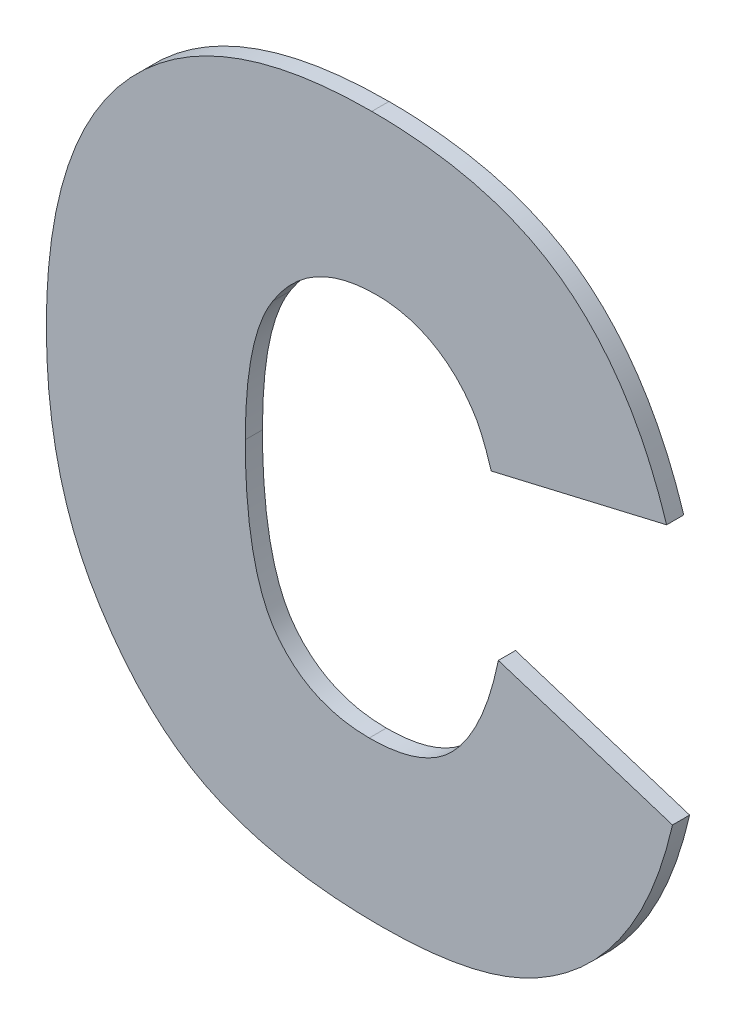
ISO-10303-21;
HEADER;
FILE_DESCRIPTION(('STEP AP214'),'2;1');
FILE_NAME('part.step','',(''),(''),'','','');
FILE_SCHEMA(('AUTOMOTIVE_DESIGN { 1 0 10303 214 1 1 1 1 }'));
ENDSEC;
DATA;
#1=APPLICATION_CONTEXT('core data for automotive mechanical design processes');
#2=APPLICATION_PROTOCOL_DEFINITION('international standard','automotive_design',2000,#1);
#3=PRODUCT_CONTEXT('',#1,'mechanical');
#4=PRODUCT('Part','Part','',(#3));
#5=PRODUCT_RELATED_PRODUCT_CATEGORY('part','',(#4));
#6=PRODUCT_DEFINITION_FORMATION('','',#4);
#7=PRODUCT_DEFINITION_CONTEXT('part definition',#1,'design');
#8=PRODUCT_DEFINITION('design','',#6,#7);
#9=PRODUCT_DEFINITION_SHAPE('','',#8);
#10=(LENGTH_UNIT() NAMED_UNIT(*) SI_UNIT(.MILLI.,.METRE.));
#11=(NAMED_UNIT(*) PLANE_ANGLE_UNIT() SI_UNIT($,.RADIAN.));
#12=(NAMED_UNIT(*) SI_UNIT($,.STERADIAN.) SOLID_ANGLE_UNIT());
#13=UNCERTAINTY_MEASURE_WITH_UNIT(LENGTH_MEASURE(1.E-05),#10,'distance_accuracy_value','');
#14=(GEOMETRIC_REPRESENTATION_CONTEXT(3) GLOBAL_UNCERTAINTY_ASSIGNED_CONTEXT((#13)) GLOBAL_UNIT_ASSIGNED_CONTEXT((#10,
#11,#12)) REPRESENTATION_CONTEXT('',''));
#15=CARTESIAN_POINT('',(0.,0.,0.));
#16=DIRECTION('',(0.,0.,1.));
#17=DIRECTION('',(1.,0.,0.));
#18=AXIS2_PLACEMENT_3D('',#15,#16,#17);
#19=CARTESIAN_POINT('',(0.829131792245526,-0.646000658730181,0.));
#20=DIRECTION('',(0.228030488835568,-0.973653992012261,0.));
#21=DIRECTION('',(0.973653992012261,0.228030488835568,0.));
#22=AXIS2_PLACEMENT_3D('',#19,#20,#21);
#23=PLANE('',#22);
#24=DIRECTION('',(0.973653992012261,0.228030488835568,0.));
#25=VECTOR('',#24,1.);
#26=CARTESIAN_POINT('',(0.829131792245526,-0.646000658730181,0.));
#27=LINE('',#26,#25);
#28=CARTESIAN_POINT('',(0.829131792245526,-0.646000658730181,0.));
#29=VERTEX_POINT('',#28);
#30=CARTESIAN_POINT('',(0.85982730677854,-0.638811746404606,0.));
#31=VERTEX_POINT('',#30);
#32=EDGE_CURVE('E11',#29,#31,#27,.T.);
#33=ORIENTED_EDGE('',*,*,#32,.T.);
#34=DIRECTION('',(0.,0.,1.));
#35=VECTOR('',#34,1.);
#36=CARTESIAN_POINT('',(0.85982730677854,-0.638811746404606,0.));
#37=LINE('',#36,#35);
#38=CARTESIAN_POINT('',(0.85982730677854,-0.638811746404606,0.003));
#39=VERTEX_POINT('',#38);
#40=EDGE_CURVE('E24',#31,#39,#37,.T.);
#41=ORIENTED_EDGE('',*,*,#40,.T.);
#42=DIRECTION('',(0.973653992012261,0.228030488835568,0.));
#43=VECTOR('',#42,1.);
#44=CARTESIAN_POINT('',(0.829131792245526,-0.646000658730181,0.003));
#45=LINE('',#44,#43);
#46=CARTESIAN_POINT('',(0.829131792245526,-0.646000658730181,0.003));
#47=VERTEX_POINT('',#46);
#48=EDGE_CURVE('E124',#47,#39,#45,.T.);
#49=ORIENTED_EDGE('',*,*,#48,.F.);
#50=DIRECTION('',(0.,0.,1.));
#51=VECTOR('',#50,1.);
#52=CARTESIAN_POINT('',(0.829131792245526,-0.646000658730181,0.));
#53=LINE('',#52,#51);
#54=EDGE_CURVE('E348',#29,#47,#53,.T.);
#55=ORIENTED_EDGE('',*,*,#54,.F.);
#56=EDGE_LOOP('',(#33,#41,#49,#55));
#57=FACE_BOUND('',#56,.T.);
#58=ADVANCED_FACE('F17',(#57),#23,.T.);
#59=CARTESIAN_POINT('',(0.825708500661921,-0.638127088087888,0.));
#60=CARTESIAN_POINT('',(0.825708500661921,-0.638127088087888,0.003));
#61=CARTESIAN_POINT('',(0.827534257231295,-0.640637501146391,0.));
#62=CARTESIAN_POINT('',(0.827534257231295,-0.640637501146391,0.003));
#63=CARTESIAN_POINT('',(0.829131792245526,-0.646000658730181,0.));
#64=CARTESIAN_POINT('',(0.829131792245526,-0.646000658730181,0.003));
#65=B_SPLINE_SURFACE_WITH_KNOTS('',2,1,((#59,#60),(#61,#62),(#63,#64)),.UNSPECIFIED.,.F.,.F.,
.F.,(3,3),(2,2),(-1.,0.),(0.,0.0003),.UNSPECIFIED.);
#66=CARTESIAN_POINT('',(0.825708500661921,-0.638127088087888,0.));
#67=CARTESIAN_POINT('',(0.827534257231295,-0.640637501146391,0.));
#68=CARTESIAN_POINT('',(0.829131792245526,-0.646000658730181,0.));
#69=B_SPLINE_CURVE_WITH_KNOTS('',2,(#66,#67,#68),.UNSPECIFIED.,.F.,.F.,(3,3),(-1.,0.),.UNSPECIFIED.);
#70=CARTESIAN_POINT('',(0.825708500661921,-0.638127088087888,0.));
#71=VERTEX_POINT('',#70);
#72=EDGE_CURVE('E338',#71,#29,#69,.T.);
#73=CARTESIAN_POINT('',(0.825708500661921,-0.638127088087888,0.003));
#74=CARTESIAN_POINT('',(0.827534257231295,-0.640637501146391,0.003));
#75=CARTESIAN_POINT('',(0.829131792245526,-0.646000658730181,0.003));
#76=B_SPLINE_CURVE_WITH_KNOTS('',2,(#73,#74,#75),.UNSPECIFIED.,.F.,.F.,(3,3),(-1.,0.),.UNSPECIFIED.);
#77=CARTESIAN_POINT('',(0.825708500661921,-0.638127088087888,0.003));
#78=VERTEX_POINT('',#77);
#79=EDGE_CURVE('E329',#78,#47,#76,.T.);
#80=DIRECTION('',(0.,0.,1.));
#81=VECTOR('',#80,1.);
#82=CARTESIAN_POINT('',(0.825708500661921,-0.638127088087888,0.));
#83=LINE('',#82,#81);
#84=EDGE_CURVE('E327',#71,#78,#83,.T.);
#85=ORIENTED_EDGE('',*,*,#72,.T.);
#86=ORIENTED_EDGE('',*,*,#54,.T.);
#87=ORIENTED_EDGE('',*,*,#79,.F.);
#88=ORIENTED_EDGE('',*,*,#84,.F.);
#89=EDGE_LOOP('',(#85,#86,#87,#88));
#90=FACE_BOUND('',#89,.T.);
#91=ADVANCED_FACE('F296',(#90),#65,.T.);
#92=CARTESIAN_POINT('',(0.825708500661921,-0.638127088087888,0.));
#93=CARTESIAN_POINT('',(0.819767609909563,-0.629278002142174,0.));
#94=CARTESIAN_POINT('',(0.809048481621696,-0.629340639689959,0.));
#95=CARTESIAN_POINT('',(0.825708500661921,-0.638127088087888,0.003));
#96=CARTESIAN_POINT('',(0.819767609909563,-0.629278002142174,0.003));
#97=CARTESIAN_POINT('',(0.809048481621696,-0.629340639689959,0.003));
#98=(BOUNDED_SURFACE() B_SPLINE_SURFACE(1,2,((#92,#93,#94),(#95,#96,#97)),.UNSPECIFIED.,.F.,.F.,
.F.) B_SPLINE_SURFACE_WITH_KNOTS((2,2),(3,3),(0.,0.0955551908147247),(-0.382239939426614,
0.409229730828909),
.UNSPECIFIED.) GEOMETRIC_REPRESENTATION_ITEM() RATIONAL_B_SPLINE_SURFACE(((1.,0.922713544612918,
1.),(1.,0.922713544612918,1.))) REPRESENTATION_ITEM('') SURFACE());
#99=CARTESIAN_POINT('',(0.809048481621696,-0.629340639689959,0.));
#100=CARTESIAN_POINT('',(0.809460357798463,-0.629338206307248,0.));
#101=CARTESIAN_POINT('',(0.809872391291396,-0.629347378233275,0.));
#102=CARTESIAN_POINT('',(0.810694763271972,-0.629389478681462,0.));
#103=CARTESIAN_POINT('',(0.811105103160338,-0.629422379986214,0.));
#104=CARTESIAN_POINT('',(0.811718357446488,-0.629489931848693,0.));
#105=CARTESIAN_POINT('',(0.811922305332792,-0.629515466361286,0.));
#106=CARTESIAN_POINT('',(0.812329195565191,-0.629572629401189,0.));
#107=CARTESIAN_POINT('',(0.812532138550533,-0.62960425334526,0.));
#108=CARTESIAN_POINT('',(0.81293681309316,-0.629673626171277,0.));
#109=CARTESIAN_POINT('',(0.813138545464128,-0.629711370309974,0.));
#110=CARTESIAN_POINT('',(0.813540601481279,-0.629793002539671,0.));
#111=CARTESIAN_POINT('',(0.813740926098435,-0.629836885844304,0.));
#112=CARTESIAN_POINT('',(0.814139967362067,-0.629930804228361,0.));
#113=CARTESIAN_POINT('',(0.814338685118197,-0.629980834591321,0.));
#114=CARTESIAN_POINT('',(0.814734315089902,-0.630087043300805,0.));
#115=CARTESIAN_POINT('',(0.814931228523601,-0.630143217108099,0.));
#116=CARTESIAN_POINT('',(0.815323053796636,-0.630261697252081,0.));
#117=CARTESIAN_POINT('',(0.815517966924733,-0.630323999325521,0.));
#118=CARTESIAN_POINT('',(0.815905597902412,-0.630454708805677,0.));
#119=CARTESIAN_POINT('',(0.816098317066619,-0.630523112312877,0.));
#120=CARTESIAN_POINT('',(0.816481369379095,-0.630665985722831,0.));
#121=CARTESIAN_POINT('',(0.81667170381814,-0.630740452164341,0.));
#122=CARTESIAN_POINT('',(0.817049799529665,-0.630895400814808,0.));
#123=CARTESIAN_POINT('',(0.817237562016462,-0.630975880060294,0.));
#124=CARTESIAN_POINT('',(0.817610330866184,-0.631142792109961,0.));
#125=CARTESIAN_POINT('',(0.817795338313771,-0.63122922249153,0.));
#126=CARTESIAN_POINT('',(0.818162418914387,-0.631407963189462,0.));
#127=CARTESIAN_POINT('',(0.81834449297107,-0.631500271649898,0.));
#128=CARTESIAN_POINT('',(0.818705533975186,-0.631690683687116,0.));
#129=CARTESIAN_POINT('',(0.818884501598192,-0.631788785982925,0.));
#130=CARTESIAN_POINT('',(0.819239162819613,-0.631990689951683,0.));
#131=CARTESIAN_POINT('',(0.819414856825084,-0.632094490909616,0.));
#132=CARTESIAN_POINT('',(0.819762810308813,-0.632307685867555,0.));
#133=CARTESIAN_POINT('',(0.81993506989397,-0.6324170796931,0.));
#134=CARTESIAN_POINT('',(0.820276000927277,-0.632641343828245,0.));
#135=CARTESIAN_POINT('',(0.820444672161188,-0.632756214463512,0.));
#136=CARTESIAN_POINT('',(0.820778280219897,-0.632991305856625,0.));
#137=CARTESIAN_POINT('',(0.820943216500486,-0.633111527386663,0.));
#138=CARTESIAN_POINT('',(0.821269216122064,-0.633357184861116,0.));
#139=CARTESIAN_POINT('',(0.821430278593236,-0.633482621959688,0.));
#140=CARTESIAN_POINT('',(0.821748400180388,-0.633738566028894,0.));
#141=CARTESIAN_POINT('',(0.821905458119066,-0.633869074462637,0.));
#142=CARTESIAN_POINT('',(0.822215448635653,-0.634135008307253,0.));
#143=CARTESIAN_POINT('',(0.822368379760716,-0.634270435411377,0.));
#144=CARTESIAN_POINT('',(0.82267000344164,-0.634546046105929,0.));
#145=CARTESIAN_POINT('',(0.822818694314493,-0.634686231537945,0.));
#146=CARTESIAN_POINT('',(0.823111732918148,-0.634971190670543,0.));
#147=CARTESIAN_POINT('',(0.823256078793513,-0.63511596627856,0.));
#148=CARTESIAN_POINT('',(0.823540333143741,-0.635409933122889,0.));
#149=CARTESIAN_POINT('',(0.823680239660321,-0.635559126253262,0.));
#150=CARTESIAN_POINT('',(0.823955525944665,-0.635861741655037,0.));
#151=CARTESIAN_POINT('',(0.824090903728072,-0.636015165727958,0.));
#152=CARTESIAN_POINT('',(0.824490199756791,-0.63648159475203,0.));
#153=CARTESIAN_POINT('',(0.824747141003148,-0.636800611856273,0.));
#154=CARTESIAN_POINT('',(0.825242145624277,-0.637453296622921,0.));
#155=CARTESIAN_POINT('',(0.82548019692912,-0.637786973444125,0.));
#156=CARTESIAN_POINT('',(0.825708500661921,-0.638127088087888,0.));
#157=B_SPLINE_CURVE_WITH_KNOTS('',3,(#99,#100,#101,#102,#103,#104,#105,#106,#107,#108,#109,#110,
#111,#112,#113,#114,#115,#116,#117,#118,#119,#120,#121,#122,#123,#124,#125,#126,#127,#128,#129,
#130,#131,#132,#133,#134,#135,#136,#137,#138,#139,#140,#141,#142,#143,#144,#145,#146,#147,#148,
#149,#150,#151,#152,#153,#154,#155,#156),.UNSPECIFIED.,.F.,.F.,(4,2,2,2,2,2,2,2,2,2,2,2,2,2,2,2,
2,2,2,2,2,2,2,2,2,2,2,2,4),(0.,0.00123564401995092,0.00246987301543477,0.0030864145634669,
0.00370249386967935,0.00431809796673437,0.00493322475891014,0.00554788249501255,
0.00616208910630262,0.00677587141462806,0.00738926421858814,0.0080023092681392,
0.00861505414049851,0.00922755103245661,0.00983985548614461,0.0104520250668772,
0.0110641180128576,0.0116761918771939,0.0122883021828552,0.012900501110875,0.0135128362412665,
0.0141253493648457,0.0147380753824472,0.0153510413059789,0.0159642653734439,0.0165777562875579,
0.0171915125849771,0.0184196274218652,0.0196485207607322),.UNSPECIFIED.);
#158=CARTESIAN_POINT('',(0.809048481621696,-0.629340639689959,0.));
#159=VERTEX_POINT('',#158);
#160=EDGE_CURVE('E324',#159,#71,#157,.T.);
#161=CARTESIAN_POINT('',(0.825708500661921,-0.638127088087888,0.003));
#162=CARTESIAN_POINT('',(0.819767609909563,-0.629278002142174,0.003));
#163=CARTESIAN_POINT('',(0.809048481621696,-0.629340639689959,0.003));
#164=(BOUNDED_CURVE() B_SPLINE_CURVE(2,(#161,#162,#163),.UNSPECIFIED.,.F.,
.F.) B_SPLINE_CURVE_WITH_KNOTS((3,3),(-0.382239939426614,0.409229730828909),
.UNSPECIFIED.) CURVE() GEOMETRIC_REPRESENTATION_ITEM() RATIONAL_B_SPLINE_CURVE((1.,
0.922713544612918,1.)) REPRESENTATION_ITEM(''));
#165=CARTESIAN_POINT('',(0.809048481621696,-0.629340639689959,0.003));
#166=VERTEX_POINT('',#165);
#167=EDGE_CURVE('E278',#166,#78,#164,.F.);
#168=DIRECTION('',(0.,0.,1.));
#169=VECTOR('',#168,1.);
#170=CARTESIAN_POINT('',(0.809048481621696,-0.629340639689959,0.));
#171=LINE('',#170,#169);
#172=EDGE_CURVE('E273',#159,#166,#171,.T.);
#173=ORIENTED_EDGE('',*,*,#160,.T.);
#174=ORIENTED_EDGE('',*,*,#84,.T.);
#175=ORIENTED_EDGE('',*,*,#167,.F.);
#176=ORIENTED_EDGE('',*,*,#172,.F.);
#177=EDGE_LOOP('',(#173,#174,#175,#176));
#178=FACE_BOUND('',#177,.T.);
#179=ADVANCED_FACE('F284',(#178),#98,.T.);
#180=CARTESIAN_POINT('',(0.790905036228577,-0.639382295001876,0.));
#181=CARTESIAN_POINT('',(0.790905036228577,-0.639382295001876,0.003));
#182=CARTESIAN_POINT('',(0.797181057210155,-0.629340631197296,0.));
#183=CARTESIAN_POINT('',(0.797181057210155,-0.629340631197296,0.003));
#184=CARTESIAN_POINT('',(0.809048481621696,-0.629340639689959,0.));
#185=CARTESIAN_POINT('',(0.809048481621696,-0.629340639689959,0.003));
#186=B_SPLINE_SURFACE_WITH_KNOTS('',2,1,((#180,#181),(#182,#183),(#184,#185)),.UNSPECIFIED.,.F.,
.F.,.F.,(3,3),(2,2),(-1.,0.),(0.,0.0003),.UNSPECIFIED.);
#187=CARTESIAN_POINT('',(0.790905036228577,-0.639382295001876,0.));
#188=CARTESIAN_POINT('',(0.797181057210155,-0.629340631197296,0.));
#189=CARTESIAN_POINT('',(0.809048481621696,-0.629340639689959,0.));
#190=B_SPLINE_CURVE_WITH_KNOTS('',2,(#187,#188,#189),.UNSPECIFIED.,.F.,.F.,(3,3),(-1.,0.),.UNSPECIFIED.);
#191=CARTESIAN_POINT('',(0.790905036228577,-0.639382295001876,0.));
#192=VERTEX_POINT('',#191);
#193=EDGE_CURVE('E263',#192,#159,#190,.T.);
#194=CARTESIAN_POINT('',(0.790905036228577,-0.639382295001876,0.003));
#195=CARTESIAN_POINT('',(0.797181057210155,-0.629340631197296,0.003));
#196=CARTESIAN_POINT('',(0.809048481621696,-0.629340639689959,0.003));
#197=B_SPLINE_CURVE_WITH_KNOTS('',2,(#194,#195,#196),.UNSPECIFIED.,.F.,.F.,(3,3),(-1.,0.),.UNSPECIFIED.);
#198=CARTESIAN_POINT('',(0.790905036228577,-0.639382295001876,0.003));
#199=VERTEX_POINT('',#198);
#200=EDGE_CURVE('E253',#199,#166,#197,.T.);
#201=DIRECTION('',(0.,0.,1.));
#202=VECTOR('',#201,1.);
#203=CARTESIAN_POINT('',(0.790905036228577,-0.639382295001876,0.));
#204=LINE('',#203,#202);
#205=EDGE_CURVE('E247',#192,#199,#204,.T.);
#206=ORIENTED_EDGE('',*,*,#193,.T.);
#207=ORIENTED_EDGE('',*,*,#172,.T.);
#208=ORIENTED_EDGE('',*,*,#200,.F.);
#209=ORIENTED_EDGE('',*,*,#205,.F.);
#210=EDGE_LOOP('',(#206,#207,#208,#209));
#211=FACE_BOUND('',#210,.T.);
#212=ADVANCED_FACE('F295',(#211),#186,.T.);
#213=CARTESIAN_POINT('',(0.786112428011526,-0.662774787489859,0.));
#214=CARTESIAN_POINT('',(0.786112428011526,-0.662774787489859,0.003));
#215=CARTESIAN_POINT('',(0.786112400537066,-0.646799426766351,0.));
#216=CARTESIAN_POINT('',(0.786112400537066,-0.646799426766351,0.003));
#217=CARTESIAN_POINT('',(0.790905036228577,-0.639382295001876,0.));
#218=CARTESIAN_POINT('',(0.790905036228577,-0.639382295001876,0.003));
#219=B_SPLINE_SURFACE_WITH_KNOTS('',2,1,((#213,#214),(#215,#216),(#217,#218)),.UNSPECIFIED.,.F.,
.F.,.F.,(3,3),(2,2),(-1.,0.),(0.,0.0003),.UNSPECIFIED.);
#220=CARTESIAN_POINT('',(0.786112428011526,-0.662774787489859,0.));
#221=CARTESIAN_POINT('',(0.786112400537066,-0.646799426766351,0.));
#222=CARTESIAN_POINT('',(0.790905036228577,-0.639382295001876,0.));
#223=B_SPLINE_CURVE_WITH_KNOTS('',2,(#220,#221,#222),.UNSPECIFIED.,.F.,.F.,(3,3),(-1.,0.),.UNSPECIFIED.);
#224=CARTESIAN_POINT('',(0.786112428011526,-0.662774787489859,0.));
#225=VERTEX_POINT('',#224);
#226=EDGE_CURVE('E239',#225,#192,#223,.T.);
#227=CARTESIAN_POINT('',(0.786112428011526,-0.662774787489859,0.003));
#228=CARTESIAN_POINT('',(0.786112400537066,-0.646799426766351,0.003));
#229=CARTESIAN_POINT('',(0.790905036228577,-0.639382295001876,0.003));
#230=B_SPLINE_CURVE_WITH_KNOTS('',2,(#227,#228,#229),.UNSPECIFIED.,.F.,.F.,(3,3),(-1.,0.),.UNSPECIFIED.);
#231=CARTESIAN_POINT('',(0.786112428011526,-0.662774787489859,0.003));
#232=VERTEX_POINT('',#231);
#233=EDGE_CURVE('E234',#232,#199,#230,.T.);
#234=DIRECTION('',(0.,0.,1.));
#235=VECTOR('',#234,1.);
#236=CARTESIAN_POINT('',(0.786112428011526,-0.662774787489859,0.));
#237=LINE('',#236,#235);
#238=EDGE_CURVE('E228',#225,#232,#237,.T.);
#239=ORIENTED_EDGE('',*,*,#226,.T.);
#240=ORIENTED_EDGE('',*,*,#205,.T.);
#241=ORIENTED_EDGE('',*,*,#233,.F.);
#242=ORIENTED_EDGE('',*,*,#238,.F.);
#243=EDGE_LOOP('',(#239,#240,#241,#242));
#244=FACE_BOUND('',#243,.T.);
#245=ADVANCED_FACE('F368',(#244),#219,.T.);
#246=CARTESIAN_POINT('',(0.807793274707708,-0.697121813045389,0.));
#247=CARTESIAN_POINT('',(0.807793274707708,-0.697121813045389,0.003));
#248=CARTESIAN_POINT('',(0.797523399956879,-0.69712181289239,0.));
#249=CARTESIAN_POINT('',(0.797523399956879,-0.69712181289239,0.003));
#250=CARTESIAN_POINT('',(0.78611242822908,-0.68251576863228,0.));
#251=CARTESIAN_POINT('',(0.78611242822908,-0.68251576863228,0.003));
#252=CARTESIAN_POINT('',(0.786112428011526,-0.662774787489859,0.));
#253=CARTESIAN_POINT('',(0.786112428011526,-0.662774787489859,0.003));
#254=B_SPLINE_SURFACE_WITH_KNOTS('',2,1,((#246,#247),(#248,#249),(#250,#251),(#252,#253)),
.UNSPECIFIED.,.F.,.F.,.F.,(3,1,3),(2,2),(-2.,-1.,0.),(0.,0.0003),.UNSPECIFIED.);
#255=CARTESIAN_POINT('',(0.807793274707708,-0.697121813045389,0.));
#256=CARTESIAN_POINT('',(0.797523399956879,-0.69712181289239,0.));
#257=CARTESIAN_POINT('',(0.78611242822908,-0.68251576863228,0.));
#258=CARTESIAN_POINT('',(0.786112428011526,-0.662774787489859,0.));
#259=B_SPLINE_CURVE_WITH_KNOTS('',2,(#255,#256,#257,#258),.UNSPECIFIED.,.F.,.F.,(3,1,3),(-2.,
-1.,0.),.UNSPECIFIED.);
#260=CARTESIAN_POINT('',(0.807793274707708,-0.697121813045389,0.));
#261=VERTEX_POINT('',#260);
#262=EDGE_CURVE('E220',#261,#225,#259,.T.);
#263=CARTESIAN_POINT('',(0.807793274707708,-0.697121813045389,0.003));
#264=CARTESIAN_POINT('',(0.797523399956879,-0.69712181289239,0.003));
#265=CARTESIAN_POINT('',(0.78611242822908,-0.68251576863228,0.003));
#266=CARTESIAN_POINT('',(0.786112428011526,-0.662774787489859,0.003));
#267=B_SPLINE_CURVE_WITH_KNOTS('',2,(#263,#264,#265,#266),.UNSPECIFIED.,.F.,.F.,(3,1,3),(-2.,
-1.,0.),.UNSPECIFIED.);
#268=CARTESIAN_POINT('',(0.807793274707708,-0.697121813045389,0.003));
#269=VERTEX_POINT('',#268);
#270=EDGE_CURVE('E215',#269,#232,#267,.T.);
#271=DIRECTION('',(0.,0.,1.));
#272=VECTOR('',#271,1.);
#273=CARTESIAN_POINT('',(0.807793274707708,-0.697121813045389,0.));
#274=LINE('',#273,#272);
#275=EDGE_CURVE('E209',#261,#269,#274,.T.);
#276=ORIENTED_EDGE('',*,*,#262,.T.);
#277=ORIENTED_EDGE('',*,*,#238,.T.);
#278=ORIENTED_EDGE('',*,*,#270,.F.);
#279=ORIENTED_EDGE('',*,*,#275,.F.);
#280=EDGE_LOOP('',(#276,#277,#278,#279));
#281=FACE_BOUND('',#280,.T.);
#282=ADVANCED_FACE('F365',(#281),#254,.T.);
#283=CARTESIAN_POINT('',(0.830386999159515,-0.674071649715764,0.));
#284=CARTESIAN_POINT('',(0.830386999159515,-0.674071649715764,0.003));
#285=CARTESIAN_POINT('',(0.828104811674292,-0.685368513336354,0.));
#286=CARTESIAN_POINT('',(0.828104811674292,-0.685368513336354,0.003));
#287=CARTESIAN_POINT('',(0.817834944106267,-0.69712182071634,0.));
#288=CARTESIAN_POINT('',(0.817834944106267,-0.69712182071634,0.003));
#289=CARTESIAN_POINT('',(0.807793274707708,-0.697121813045389,0.));
#290=CARTESIAN_POINT('',(0.807793274707708,-0.697121813045389,0.003));
#291=B_SPLINE_SURFACE_WITH_KNOTS('',2,1,((#283,#284),(#285,#286),(#287,#288),(#289,#290)),
.UNSPECIFIED.,.F.,.F.,.F.,(3,1,3),(2,2),(-2.,-1.,0.),(0.,0.0003),.UNSPECIFIED.);
#292=CARTESIAN_POINT('',(0.830386999159515,-0.674071649715764,0.));
#293=CARTESIAN_POINT('',(0.828104811674292,-0.685368513336354,0.));
#294=CARTESIAN_POINT('',(0.817834944106267,-0.69712182071634,0.));
#295=CARTESIAN_POINT('',(0.807793274707708,-0.697121813045389,0.));
#296=B_SPLINE_CURVE_WITH_KNOTS('',2,(#292,#293,#294,#295),.UNSPECIFIED.,.F.,.F.,(3,1,3),(-2.,
-1.,0.),.UNSPECIFIED.);
#297=CARTESIAN_POINT('',(0.830386999159515,-0.674071649715764,0.));
#298=VERTEX_POINT('',#297);
#299=EDGE_CURVE('E201',#298,#261,#296,.T.);
#300=CARTESIAN_POINT('',(0.830386999159515,-0.674071649715764,0.003));
#301=CARTESIAN_POINT('',(0.828104811674292,-0.685368513336354,0.003));
#302=CARTESIAN_POINT('',(0.817834944106267,-0.69712182071634,0.003));
#303=CARTESIAN_POINT('',(0.807793274707708,-0.697121813045389,0.003));
#304=B_SPLINE_CURVE_WITH_KNOTS('',2,(#300,#301,#302,#303),.UNSPECIFIED.,.F.,.F.,(3,1,3),(-2.,
-1.,0.),.UNSPECIFIED.);
#305=CARTESIAN_POINT('',(0.830386999159515,-0.674071649715764,0.003));
#306=VERTEX_POINT('',#305);
#307=EDGE_CURVE('E196',#306,#269,#304,.T.);
#308=DIRECTION('',(0.,0.,1.));
#309=VECTOR('',#308,1.);
#310=CARTESIAN_POINT('',(0.830386999159515,-0.674071649715764,0.));
#311=LINE('',#310,#309);
#312=EDGE_CURVE('E193',#298,#306,#311,.T.);
#313=ORIENTED_EDGE('',*,*,#299,.T.);
#314=ORIENTED_EDGE('',*,*,#275,.T.);
#315=ORIENTED_EDGE('',*,*,#307,.F.);
#316=ORIENTED_EDGE('',*,*,#312,.F.);
#317=EDGE_LOOP('',(#313,#314,#315,#316));
#318=FACE_BOUND('',#317,.T.);
#319=ADVANCED_FACE('F362',(#318),#291,.T.);
#320=CARTESIAN_POINT('',(0.860854294253625,-0.683770975869316,0.));
#321=DIRECTION('',(0.303350960157247,0.952878898376744,0.));
#322=DIRECTION('',(-0.952878898376744,0.303350960157247,0.));
#323=AXIS2_PLACEMENT_3D('',#320,#321,#322);
#324=PLANE('',#323);
#325=DIRECTION('',(-0.952878898376744,0.303350960157247,0.));
#326=VECTOR('',#325,1.);
#327=CARTESIAN_POINT('',(0.860854294253625,-0.683770975869316,0.));
#328=LINE('',#327,#326);
#329=CARTESIAN_POINT('',(0.860854294253625,-0.683770975869316,0.));
#330=VERTEX_POINT('',#329);
#331=EDGE_CURVE('E190',#330,#298,#328,.T.);
#332=ORIENTED_EDGE('',*,*,#331,.T.);
#333=ORIENTED_EDGE('',*,*,#312,.T.);
#334=DIRECTION('',(-0.952878898376744,0.303350960157247,0.));
#335=VECTOR('',#334,1.);
#336=CARTESIAN_POINT('',(0.860854294253625,-0.683770975869316,0.003));
#337=LINE('',#336,#335);
#338=CARTESIAN_POINT('',(0.860854294253625,-0.683770975869316,0.003));
#339=VERTEX_POINT('',#338);
#340=EDGE_CURVE('E187',#339,#306,#337,.T.);
#341=ORIENTED_EDGE('',*,*,#340,.F.);
#342=DIRECTION('',(0.,0.,1.));
#343=VECTOR('',#342,1.);
#344=CARTESIAN_POINT('',(0.860854294253625,-0.683770975869316,0.));
#345=LINE('',#344,#343);
#346=EDGE_CURVE('E181',#330,#339,#345,.T.);
#347=ORIENTED_EDGE('',*,*,#346,.F.);
#348=EDGE_LOOP('',(#332,#333,#341,#347));
#349=FACE_BOUND('',#348,.T.);
#350=ADVANCED_FACE('F359',(#349),#324,.T.);
#351=CARTESIAN_POINT('',(0.809847249657872,-0.724622255433702,0.));
#352=CARTESIAN_POINT('',(0.809847249657872,-0.724622255433702,0.003));
#353=CARTESIAN_POINT('',(0.825023842345145,-0.724622218139088,0.));
#354=CARTESIAN_POINT('',(0.825023842345145,-0.724622218139088,0.003));
#355=CARTESIAN_POINT('',(0.84453658165845,-0.715379282913168,0.));
#356=CARTESIAN_POINT('',(0.84453658165845,-0.715379282913168,0.003));
#357=CARTESIAN_POINT('',(0.857773264529774,-0.697235804992497,0.));
#358=CARTESIAN_POINT('',(0.857773264529774,-0.697235804992497,0.003));
#359=CARTESIAN_POINT('',(0.860854294253625,-0.683770975869316,0.));
#360=CARTESIAN_POINT('',(0.860854294253625,-0.683770975869316,0.003));
#361=B_SPLINE_SURFACE_WITH_KNOTS('',2,1,((#351,#352),(#353,#354),(#355,#356),(#357,#358),(#359,
#360)),.UNSPECIFIED.,.F.,.F.,.F.,(3,1,1,3),(2,2),(-3.,-2.,-1.,0.),(0.,0.0003),.UNSPECIFIED.);
#362=CARTESIAN_POINT('',(0.809847249657872,-0.724622255433702,0.));
#363=CARTESIAN_POINT('',(0.825023842345145,-0.724622218139088,0.));
#364=CARTESIAN_POINT('',(0.84453658165845,-0.715379282913168,0.));
#365=CARTESIAN_POINT('',(0.857773264529774,-0.697235804992497,0.));
#366=CARTESIAN_POINT('',(0.860854294253625,-0.683770975869316,0.));
#367=B_SPLINE_CURVE_WITH_KNOTS('',2,(#362,#363,#364,#365,#366),.UNSPECIFIED.,.F.,.F.,(3,1,1,3),
(-3.,-2.,-1.,0.),.UNSPECIFIED.);
#368=CARTESIAN_POINT('',(0.809847249657872,-0.724622255433702,0.));
#369=VERTEX_POINT('',#368);
#370=EDGE_CURVE('E173',#369,#330,#367,.T.);
#371=CARTESIAN_POINT('',(0.809847249657872,-0.724622255433702,0.003));
#372=CARTESIAN_POINT('',(0.825023842345145,-0.724622218139088,0.003));
#373=CARTESIAN_POINT('',(0.84453658165845,-0.715379282913168,0.003));
#374=CARTESIAN_POINT('',(0.857773264529774,-0.697235804992497,0.003));
#375=CARTESIAN_POINT('',(0.860854294253625,-0.683770975869316,0.003));
#376=B_SPLINE_CURVE_WITH_KNOTS('',2,(#371,#372,#373,#374,#375),.UNSPECIFIED.,.F.,.F.,(3,1,1,3),
(-3.,-2.,-1.,0.),.UNSPECIFIED.);
#377=CARTESIAN_POINT('',(0.809847249657872,-0.724622255433702,0.003));
#378=VERTEX_POINT('',#377);
#379=EDGE_CURVE('E168',#378,#339,#376,.T.);
#380=DIRECTION('',(0.,0.,1.));
#381=VECTOR('',#380,1.);
#382=CARTESIAN_POINT('',(0.809847249657872,-0.724622255433702,0.));
#383=LINE('',#382,#381);
#384=EDGE_CURVE('E162',#369,#378,#383,.T.);
#385=ORIENTED_EDGE('',*,*,#370,.T.);
#386=ORIENTED_EDGE('',*,*,#346,.T.);
#387=ORIENTED_EDGE('',*,*,#379,.F.);
#388=ORIENTED_EDGE('',*,*,#384,.F.);
#389=EDGE_LOOP('',(#385,#386,#387,#388));
#390=FACE_BOUND('',#389,.T.);
#391=ADVANCED_FACE('F356',(#390),#361,.T.);
#392=CARTESIAN_POINT('',(0.751308963578186,-0.66300300692877,0.));
#393=CARTESIAN_POINT('',(0.751308963578186,-0.66300300692877,0.003));
#394=CARTESIAN_POINT('',(0.7513090427397,-0.685026182783159,0.));
#395=CARTESIAN_POINT('',(0.7513090427397,-0.685026182783159,0.003));
#396=CARTESIAN_POINT('',(0.768197382939227,-0.71332533250329,0.));
#397=CARTESIAN_POINT('',(0.768197382939227,-0.71332533250329,0.003));
#398=CARTESIAN_POINT('',(0.791475806313678,-0.724622111055851,0.));
#399=CARTESIAN_POINT('',(0.791475806313678,-0.724622111055851,0.003));
#400=CARTESIAN_POINT('',(0.809847249657872,-0.724622255433702,0.));
#401=CARTESIAN_POINT('',(0.809847249657872,-0.724622255433702,0.003));
#402=B_SPLINE_SURFACE_WITH_KNOTS('',2,1,((#392,#393),(#394,#395),(#396,#397),(#398,#399),(#400,
#401)),.UNSPECIFIED.,.F.,.F.,.F.,(3,1,1,3),(2,2),(-3.,-2.,-1.,0.),(0.,0.0003),.UNSPECIFIED.);
#403=CARTESIAN_POINT('',(0.751308963578186,-0.66300300692877,0.));
#404=CARTESIAN_POINT('',(0.7513090427397,-0.685026182783159,0.));
#405=CARTESIAN_POINT('',(0.768197382939227,-0.71332533250329,0.));
#406=CARTESIAN_POINT('',(0.791475806313678,-0.724622111055851,0.));
#407=CARTESIAN_POINT('',(0.809847249657872,-0.724622255433702,0.));
#408=B_SPLINE_CURVE_WITH_KNOTS('',2,(#403,#404,#405,#406,#407),.UNSPECIFIED.,.F.,.F.,(3,1,1,3),
(-3.,-2.,-1.,0.),.UNSPECIFIED.);
#409=CARTESIAN_POINT('',(0.751308963578186,-0.66300300692877,0.));
#410=VERTEX_POINT('',#409);
#411=EDGE_CURVE('E154',#410,#369,#408,.T.);
#412=CARTESIAN_POINT('',(0.751308963578186,-0.66300300692877,0.003));
#413=CARTESIAN_POINT('',(0.7513090427397,-0.685026182783159,0.003));
#414=CARTESIAN_POINT('',(0.768197382939227,-0.71332533250329,0.003));
#415=CARTESIAN_POINT('',(0.791475806313678,-0.724622111055851,0.003));
#416=CARTESIAN_POINT('',(0.809847249657872,-0.724622255433702,0.003));
#417=B_SPLINE_CURVE_WITH_KNOTS('',2,(#412,#413,#414,#415,#416),.UNSPECIFIED.,.F.,.F.,(3,1,1,3),
(-3.,-2.,-1.,0.),.UNSPECIFIED.);
#418=CARTESIAN_POINT('',(0.751308963578186,-0.66300300692877,0.003));
#419=VERTEX_POINT('',#418);
#420=EDGE_CURVE('E150',#419,#378,#417,.T.);
#421=DIRECTION('',(0.,0.,1.));
#422=VECTOR('',#421,1.);
#423=CARTESIAN_POINT('',(0.751308963578186,-0.66300300692877,0.));
#424=LINE('',#423,#422);
#425=EDGE_CURVE('E109',#410,#419,#424,.T.);
#426=ORIENTED_EDGE('',*,*,#411,.T.);
#427=ORIENTED_EDGE('',*,*,#384,.T.);
#428=ORIENTED_EDGE('',*,*,#420,.F.);
#429=ORIENTED_EDGE('',*,*,#425,.F.);
#430=EDGE_LOOP('',(#426,#427,#428,#429));
#431=FACE_BOUND('',#430,.T.);
#432=ADVANCED_FACE('F354',(#431),#402,.T.);
#433=CARTESIAN_POINT('',(0.808249713585522,-0.601954307021101,0.));
#434=CARTESIAN_POINT('',(0.808249713585522,-0.601954307021101,0.003));
#435=CARTESIAN_POINT('',(0.781091600355623,-0.601954311877362,0.));
#436=CARTESIAN_POINT('',(0.781091600355623,-0.601954311877362,0.003));
#437=CARTESIAN_POINT('',(0.751308969230159,-0.633562709491514,0.));
#438=CARTESIAN_POINT('',(0.751308969230159,-0.633562709491514,0.003));
#439=CARTESIAN_POINT('',(0.751308963578186,-0.66300300692877,0.));
#440=CARTESIAN_POINT('',(0.751308963578186,-0.66300300692877,0.003));
#441=B_SPLINE_SURFACE_WITH_KNOTS('',2,1,((#433,#434),(#435,#436),(#437,#438),(#439,#440)),
.UNSPECIFIED.,.F.,.F.,.F.,(3,1,3),(2,2),(-2.,-1.,0.),(0.,0.0003),.UNSPECIFIED.);
#442=CARTESIAN_POINT('',(0.808249713585522,-0.601954307021101,0.));
#443=CARTESIAN_POINT('',(0.781091600355623,-0.601954311877362,0.));
#444=CARTESIAN_POINT('',(0.751308969230159,-0.633562709491514,0.));
#445=CARTESIAN_POINT('',(0.751308963578186,-0.66300300692877,0.));
#446=B_SPLINE_CURVE_WITH_KNOTS('',2,(#442,#443,#444,#445),.UNSPECIFIED.,.F.,.F.,(3,1,3),(-2.,
-1.,0.),.UNSPECIFIED.);
#447=CARTESIAN_POINT('',(0.808249713585522,-0.601954307021101,0.));
#448=VERTEX_POINT('',#447);
#449=EDGE_CURVE('E113',#448,#410,#446,.T.);
#450=CARTESIAN_POINT('',(0.808249713585522,-0.601954307021101,0.003));
#451=CARTESIAN_POINT('',(0.781091600355623,-0.601954311877362,0.003));
#452=CARTESIAN_POINT('',(0.751308969230159,-0.633562709491514,0.003));
#453=CARTESIAN_POINT('',(0.751308963578186,-0.66300300692877,0.003));
#454=B_SPLINE_CURVE_WITH_KNOTS('',2,(#450,#451,#452,#453),.UNSPECIFIED.,.F.,.F.,(3,1,3),(-2.,
-1.,0.),.UNSPECIFIED.);
#455=CARTESIAN_POINT('',(0.808249713585522,-0.601954307021101,0.003));
#456=VERTEX_POINT('',#455);
#457=EDGE_CURVE('E102',#456,#419,#454,.T.);
#458=DIRECTION('',(0.,0.,1.));
#459=VECTOR('',#458,1.);
#460=CARTESIAN_POINT('',(0.808249713585522,-0.601954307021101,0.));
#461=LINE('',#460,#459);
#462=EDGE_CURVE('E106',#448,#456,#461,.T.);
#463=ORIENTED_EDGE('',*,*,#449,.T.);
#464=ORIENTED_EDGE('',*,*,#425,.T.);
#465=ORIENTED_EDGE('',*,*,#457,.F.);
#466=ORIENTED_EDGE('',*,*,#462,.F.);
#467=EDGE_LOOP('',(#463,#464,#465,#466));
#468=FACE_BOUND('',#467,.T.);
#469=ADVANCED_FACE('F105',(#468),#441,.T.);
#470=CARTESIAN_POINT('',(0.85982730677854,-0.638811746404606,0.));
#471=CARTESIAN_POINT('',(0.85982730677854,-0.638811746404606,0.003));
#472=CARTESIAN_POINT('',(0.853893542248641,-0.620097771159139,0.));
#473=CARTESIAN_POINT('',(0.853893542248641,-0.620097771159139,0.003));
#474=CARTESIAN_POINT('',(0.829588114689152,-0.601954402547958,0.));
#475=CARTESIAN_POINT('',(0.829588114689152,-0.601954402547958,0.003));
#476=CARTESIAN_POINT('',(0.808249713585522,-0.601954307021101,0.));
#477=CARTESIAN_POINT('',(0.808249713585522,-0.601954307021101,0.003));
#478=B_SPLINE_SURFACE_WITH_KNOTS('',2,1,((#470,#471),(#472,#473),(#474,#475),(#476,#477)),
.UNSPECIFIED.,.F.,.F.,.F.,(3,1,3),(2,2),(-2.,-1.,0.),(0.,0.0003),.UNSPECIFIED.);
#479=CARTESIAN_POINT('',(0.85982730677854,-0.638811746404606,0.));
#480=CARTESIAN_POINT('',(0.853893542248641,-0.620097771159139,0.));
#481=CARTESIAN_POINT('',(0.829588114689152,-0.601954402547958,0.));
#482=CARTESIAN_POINT('',(0.808249713585522,-0.601954307021101,0.));
#483=B_SPLINE_CURVE_WITH_KNOTS('',2,(#479,#480,#481,#482),.UNSPECIFIED.,.F.,.F.,(3,1,3),(-2.,
-1.,0.),.UNSPECIFIED.);
#484=EDGE_CURVE('E119',#31,#448,#483,.T.);
#485=CARTESIAN_POINT('',(0.85982730677854,-0.638811746404606,0.003));
#486=CARTESIAN_POINT('',(0.853893542248641,-0.620097771159139,0.003));
#487=CARTESIAN_POINT('',(0.829588114689152,-0.601954402547958,0.003));
#488=CARTESIAN_POINT('',(0.808249713585522,-0.601954307021101,0.003));
#489=B_SPLINE_CURVE_WITH_KNOTS('',2,(#485,#486,#487,#488),.UNSPECIFIED.,.F.,.F.,(3,1,3),(-2.,
-1.,0.),.UNSPECIFIED.);
#490=EDGE_CURVE('E118',#39,#456,#489,.T.);
#491=ORIENTED_EDGE('',*,*,#484,.T.);
#492=ORIENTED_EDGE('',*,*,#462,.T.);
#493=ORIENTED_EDGE('',*,*,#490,.F.);
#494=ORIENTED_EDGE('',*,*,#40,.F.);
#495=EDGE_LOOP('',(#491,#492,#493,#494));
#496=FACE_BOUND('',#495,.T.);
#497=ADVANCED_FACE('F117',(#496),#478,.T.);
#498=CARTESIAN_POINT('',(0.806081628915905,-0.663288281227402,0.003));
#499=DIRECTION('',(0.,0.,1.));
#500=DIRECTION('',(1.,0.,0.));
#501=AXIS2_PLACEMENT_3D('',#498,#499,#500);
#502=PLANE('',#501);
#503=ORIENTED_EDGE('',*,*,#490,.T.);
#504=ORIENTED_EDGE('',*,*,#457,.T.);
#505=ORIENTED_EDGE('',*,*,#420,.T.);
#506=ORIENTED_EDGE('',*,*,#379,.T.);
#507=ORIENTED_EDGE('',*,*,#340,.T.);
#508=ORIENTED_EDGE('',*,*,#307,.T.);
#509=ORIENTED_EDGE('',*,*,#270,.T.);
#510=ORIENTED_EDGE('',*,*,#233,.T.);
#511=ORIENTED_EDGE('',*,*,#200,.T.);
#512=ORIENTED_EDGE('',*,*,#167,.T.);
#513=ORIENTED_EDGE('',*,*,#79,.T.);
#514=ORIENTED_EDGE('',*,*,#48,.T.);
#515=EDGE_LOOP('',(#503,#504,#505,#506,#507,#508,#509,#510,#511,#512,#513,#514));
#516=FACE_BOUND('',#515,.T.);
#517=ADVANCED_FACE('F122',(#516),#502,.T.);
#518=CARTESIAN_POINT('',(0.806081628915905,-0.663288281227402,0.));
#519=DIRECTION('',(0.,0.,1.));
#520=DIRECTION('',(1.,0.,0.));
#521=AXIS2_PLACEMENT_3D('',#518,#519,#520);
#522=PLANE('',#521);
#523=ORIENTED_EDGE('',*,*,#484,.F.);
#524=ORIENTED_EDGE('',*,*,#32,.F.);
#525=ORIENTED_EDGE('',*,*,#72,.F.);
#526=ORIENTED_EDGE('',*,*,#160,.F.);
#527=ORIENTED_EDGE('',*,*,#193,.F.);
#528=ORIENTED_EDGE('',*,*,#226,.F.);
#529=ORIENTED_EDGE('',*,*,#262,.F.);
#530=ORIENTED_EDGE('',*,*,#299,.F.);
#531=ORIENTED_EDGE('',*,*,#331,.F.);
#532=ORIENTED_EDGE('',*,*,#370,.F.);
#533=ORIENTED_EDGE('',*,*,#411,.F.);
#534=ORIENTED_EDGE('',*,*,#449,.F.);
#535=EDGE_LOOP('',(#523,#524,#525,#526,#527,#528,#529,#530,#531,#532,#533,#534));
#536=FACE_BOUND('',#535,.T.);
#537=ADVANCED_FACE('F351',(#536),#522,.F.);
#538=CLOSED_SHELL('',(#58,#91,#179,#212,#245,#282,#319,#350,#391,#432,#469,#497,#517,#537));
#539=MANIFOLD_SOLID_BREP('B1',#538);
#540=ADVANCED_BREP_SHAPE_REPRESENTATION('',(#18,#539),#14);
#541=SHAPE_DEFINITION_REPRESENTATION(#9,#540);
ENDSEC;
END-ISO-10303-21;
